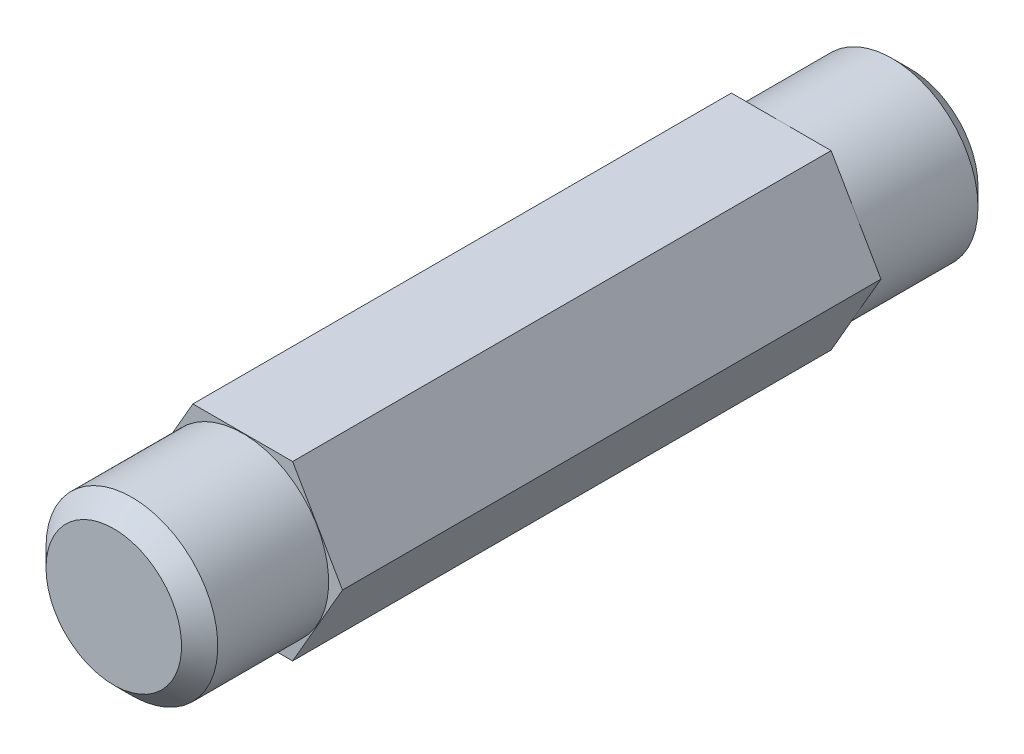
ISO-10303-21;
HEADER;
FILE_DESCRIPTION(('STEP AP214'),'2;1');
FILE_NAME('part.step','',(''),(''),'','','');
FILE_SCHEMA(('AUTOMOTIVE_DESIGN { 1 0 10303 214 1 1 1 1 }'));
ENDSEC;
DATA;
#1=APPLICATION_CONTEXT('core data for automotive mechanical design processes');
#2=APPLICATION_PROTOCOL_DEFINITION('international standard','automotive_design',2000,#1);
#3=PRODUCT_CONTEXT('',#1,'mechanical');
#4=PRODUCT('Part','Part','',(#3));
#5=PRODUCT_RELATED_PRODUCT_CATEGORY('part','',(#4));
#6=PRODUCT_DEFINITION_FORMATION('','',#4);
#7=PRODUCT_DEFINITION_CONTEXT('part definition',#1,'design');
#8=PRODUCT_DEFINITION('design','',#6,#7);
#9=PRODUCT_DEFINITION_SHAPE('','',#8);
#10=(LENGTH_UNIT() NAMED_UNIT(*) SI_UNIT(.MILLI.,.METRE.));
#11=(NAMED_UNIT(*) PLANE_ANGLE_UNIT() SI_UNIT($,.RADIAN.));
#12=(NAMED_UNIT(*) SI_UNIT($,.STERADIAN.) SOLID_ANGLE_UNIT());
#13=UNCERTAINTY_MEASURE_WITH_UNIT(LENGTH_MEASURE(1.E-05),#10,'distance_accuracy_value','');
#14=(GEOMETRIC_REPRESENTATION_CONTEXT(3) GLOBAL_UNCERTAINTY_ASSIGNED_CONTEXT((#13)) GLOBAL_UNIT_ASSIGNED_CONTEXT((#10,
#11,#12)) REPRESENTATION_CONTEXT('',''));
#15=CARTESIAN_POINT('',(0.,0.,0.));
#16=DIRECTION('',(0.,0.,1.));
#17=DIRECTION('',(1.,0.,0.));
#18=AXIS2_PLACEMENT_3D('',#15,#16,#17);
#19=CARTESIAN_POINT('',(0.,0.,21.9583));
#20=DIRECTION('',(0.,0.,1.));
#21=DIRECTION('',(1.,0.,0.));
#22=AXIS2_PLACEMENT_3D('',#19,#20,#21);
#23=PLANE('',#22);
#24=CARTESIAN_POINT('',(0.,0.,21.9582999999943));
#25=DIRECTION('',(0.,0.,-1.));
#26=DIRECTION('',(-1.,0.,0.));
#27=AXIS2_PLACEMENT_3D('',#24,#25,#26);
#28=CIRCLE('',#27,3.73710000002347);
#29=CARTESIAN_POINT('',(-3.73710000002347,0.,21.9582999999943));
#30=VERTEX_POINT('',#29);
#31=EDGE_CURVE('E20',#30,#30,#28,.T.);
#32=ORIENTED_EDGE('',*,*,#31,.F.);
#33=EDGE_LOOP('',(#32));
#34=FACE_BOUND('',#33,.T.);
#35=ADVANCED_FACE('F17',(#34),#23,.T.);
#36=CARTESIAN_POINT('',(0.,0.,-21.9583));
#37=DIRECTION('',(0.,0.,-1.));
#38=DIRECTION('',(-1.,0.,0.));
#39=AXIS2_PLACEMENT_3D('',#36,#37,#38);
#40=PLANE('',#39);
#41=CARTESIAN_POINT('',(0.,0.,-21.9583000000512));
#42=DIRECTION('',(0.,0.,1.));
#43=DIRECTION('',(1.,0.,0.));
#44=AXIS2_PLACEMENT_3D('',#41,#42,#43);
#45=CIRCLE('',#44,3.73709999996663);
#46=CARTESIAN_POINT('',(3.73709999996663,0.,-21.9583000000512));
#47=VERTEX_POINT('',#46);
#48=EDGE_CURVE('E106',#47,#47,#45,.T.);
#49=ORIENTED_EDGE('',*,*,#48,.F.);
#50=EDGE_LOOP('',(#49));
#51=FACE_BOUND('',#50,.T.);
#52=ADVANCED_FACE('F124',(#51),#40,.T.);
#53=CARTESIAN_POINT('',(0.,0.,20.9582999999043));
#54=DIRECTION('',(0.,0.,-1.));
#55=DIRECTION('',(-1.,0.,0.));
#56=AXIS2_PLACEMENT_3D('',#53,#54,#55);
#57=CONICAL_SURFACE('',#56,4.73710000011351,0.785398163397448);
#58=CARTESIAN_POINT('',(0.,0.,20.9583));
#59=DIRECTION('',(0.,0.,-1.));
#60=DIRECTION('',(-1.,0.,0.));
#61=AXIS2_PLACEMENT_3D('',#58,#59,#60);
#62=CIRCLE('',#61,4.7371);
#63=CARTESIAN_POINT('',(-4.7371,0.,20.9583));
#64=VERTEX_POINT('',#63);
#65=EDGE_CURVE('E103',#64,#64,#62,.T.);
#66=ORIENTED_EDGE('',*,*,#65,.F.);
#67=EDGE_LOOP('',(#66));
#68=FACE_BOUND('',#67,.T.);
#69=ORIENTED_EDGE('',*,*,#31,.T.);
#70=EDGE_LOOP('',(#69));
#71=FACE_BOUND('',#70,.T.);
#72=ADVANCED_FACE('F121',(#68,#71),#57,.T.);
#73=CARTESIAN_POINT('',(0.,0.,-20.958300000018));
#74=DIRECTION('',(0.,0.,1.));
#75=DIRECTION('',(1.,0.,0.));
#76=AXIS2_PLACEMENT_3D('',#73,#74,#75);
#77=CONICAL_SURFACE('',#76,4.73709999994298,0.785398163369027);
#78=CARTESIAN_POINT('',(0.,0.,-20.9583));
#79=DIRECTION('',(0.,0.,1.));
#80=DIRECTION('',(1.,0.,0.));
#81=AXIS2_PLACEMENT_3D('',#78,#79,#80);
#82=CIRCLE('',#81,4.7371);
#83=CARTESIAN_POINT('',(4.7371,0.,-20.9583));
#84=VERTEX_POINT('',#83);
#85=EDGE_CURVE('E100',#84,#84,#82,.T.);
#86=ORIENTED_EDGE('',*,*,#85,.F.);
#87=EDGE_LOOP('',(#86));
#88=FACE_BOUND('',#87,.T.);
#89=ORIENTED_EDGE('',*,*,#48,.T.);
#90=EDGE_LOOP('',(#89));
#91=FACE_BOUND('',#90,.T.);
#92=ADVANCED_FACE('F166',(#88,#91),#77,.T.);
#93=CARTESIAN_POINT('',(0.,0.,21.9583));
#94=DIRECTION('',(0.,0.,-1.));
#95=DIRECTION('',(-1.,0.,0.));
#96=AXIS2_PLACEMENT_3D('',#93,#94,#95);
#97=CYLINDRICAL_SURFACE('',#96,4.7371);
#98=CARTESIAN_POINT('',(0.,0.,14.8463));
#99=DIRECTION('',(0.,0.,-1.));
#100=DIRECTION('',(-1.,0.,0.));
#101=AXIS2_PLACEMENT_3D('',#98,#99,#100);
#102=CIRCLE('',#101,4.7371);
#103=CARTESIAN_POINT('',(-4.7371,0.,14.8463));
#104=VERTEX_POINT('',#103);
#105=EDGE_CURVE('E112',#104,#104,#102,.T.);
#106=ORIENTED_EDGE('',*,*,#105,.F.);
#107=EDGE_LOOP('',(#106));
#108=FACE_BOUND('',#107,.T.);
#109=ORIENTED_EDGE('',*,*,#65,.T.);
#110=EDGE_LOOP('',(#109));
#111=FACE_BOUND('',#110,.T.);
#112=ADVANCED_FACE('F162',(#108,#111),#97,.T.);
#113=CARTESIAN_POINT('',(0.,0.,-21.9583));
#114=DIRECTION('',(0.,0.,1.));
#115=DIRECTION('',(1.,0.,0.));
#116=AXIS2_PLACEMENT_3D('',#113,#114,#115);
#117=CYLINDRICAL_SURFACE('',#116,4.7371);
#118=CARTESIAN_POINT('',(0.,0.,-14.8463));
#119=DIRECTION('',(0.,0.,1.));
#120=DIRECTION('',(1.,0.,0.));
#121=AXIS2_PLACEMENT_3D('',#118,#119,#120);
#122=CIRCLE('',#121,4.7371);
#123=CARTESIAN_POINT('',(4.7371,0.,-14.8463));
#124=VERTEX_POINT('',#123);
#125=EDGE_CURVE('E107',#124,#124,#122,.F.);
#126=ORIENTED_EDGE('',*,*,#125,.T.);
#127=EDGE_LOOP('',(#126));
#128=FACE_BOUND('',#127,.T.);
#129=ORIENTED_EDGE('',*,*,#85,.T.);
#130=EDGE_LOOP('',(#129));
#131=FACE_BOUND('',#130,.T.);
#132=ADVANCED_FACE('F159',(#128,#131),#117,.T.);
#133=CARTESIAN_POINT('',(5.49926131403118,0.,14.8463));
#134=DIRECTION('',(-0.866025403784439,-0.5,0.));
#135=DIRECTION('',(0.5,-0.866025403784439,0.));
#136=AXIS2_PLACEMENT_3D('',#133,#134,#135);
#137=PLANE('',#136);
#138=DIRECTION('',(0.,0.,-1.));
#139=VECTOR('',#138,1.);
#140=CARTESIAN_POINT('',(2.74963065701559,4.7625,14.8463));
#141=LINE('',#140,#139);
#142=CARTESIAN_POINT('',(2.74963065701559,4.7625,-14.8463));
#143=VERTEX_POINT('',#142);
#144=CARTESIAN_POINT('',(2.74963065701559,4.7625,14.8463));
#145=VERTEX_POINT('',#144);
#146=EDGE_CURVE('E82',#143,#145,#141,.F.);
#147=ORIENTED_EDGE('',*,*,#146,.T.);
#148=DIRECTION('',(-0.5,0.866025403784439,0.));
#149=VECTOR('',#148,1.);
#150=CARTESIAN_POINT('',(5.49926131403118,0.,14.8463));
#151=LINE('',#150,#149);
#152=CARTESIAN_POINT('',(5.49926131403118,0.,14.8463));
#153=VERTEX_POINT('',#152);
#154=EDGE_CURVE('E87',#153,#145,#151,.T.);
#155=ORIENTED_EDGE('',*,*,#154,.F.);
#156=DIRECTION('',(0.,0.,1.));
#157=VECTOR('',#156,1.);
#158=CARTESIAN_POINT('',(5.49926131403118,0.,14.8463));
#159=LINE('',#158,#157);
#160=CARTESIAN_POINT('',(5.49926131403118,0.,-14.8463));
#161=VERTEX_POINT('',#160);
#162=EDGE_CURVE('E73',#153,#161,#159,.F.);
#163=ORIENTED_EDGE('',*,*,#162,.T.);
#164=DIRECTION('',(-0.5,0.866025403784439,0.));
#165=VECTOR('',#164,1.);
#166=CARTESIAN_POINT('',(5.49926131403118,0.,-14.8463));
#167=LINE('',#166,#165);
#168=EDGE_CURVE('E110',#161,#143,#167,.T.);
#169=ORIENTED_EDGE('',*,*,#168,.T.);
#170=EDGE_LOOP('',(#147,#155,#163,#169));
#171=FACE_BOUND('',#170,.T.);
#172=ADVANCED_FACE('F91',(#171),#137,.F.);
#173=CARTESIAN_POINT('',(-2.74963065701559,-4.7625,14.8463));
#174=DIRECTION('',(0.,1.,0.));
#175=DIRECTION('',(0.,0.,1.));
#176=AXIS2_PLACEMENT_3D('',#173,#174,#175);
#177=PLANE('',#176);
#178=DIRECTION('',(0.,0.,1.));
#179=VECTOR('',#178,1.);
#180=CARTESIAN_POINT('',(2.74963065701559,-4.7625,14.8463));
#181=LINE('',#180,#179);
#182=CARTESIAN_POINT('',(2.74963065701559,-4.7625,-14.8463));
#183=VERTEX_POINT('',#182);
#184=CARTESIAN_POINT('',(2.74963065701559,-4.7625,14.8463));
#185=VERTEX_POINT('',#184);
#186=EDGE_CURVE('E66',#183,#185,#181,.T.);
#187=ORIENTED_EDGE('',*,*,#186,.T.);
#188=DIRECTION('',(1.,0.,0.));
#189=VECTOR('',#188,1.);
#190=CARTESIAN_POINT('',(5.49926131403118,-4.7625,14.8463));
#191=LINE('',#190,#189);
#192=CARTESIAN_POINT('',(-2.74963065701559,-4.7625,14.8463));
#193=VERTEX_POINT('',#192);
#194=EDGE_CURVE('E89',#193,#185,#191,.T.);
#195=ORIENTED_EDGE('',*,*,#194,.F.);
#196=DIRECTION('',(0.,0.,1.));
#197=VECTOR('',#196,1.);
#198=CARTESIAN_POINT('',(-2.74963065701559,-4.7625,14.8463));
#199=LINE('',#198,#197);
#200=CARTESIAN_POINT('',(-2.74963065701559,-4.7625,-14.8463));
#201=VERTEX_POINT('',#200);
#202=EDGE_CURVE('E111',#193,#201,#199,.F.);
#203=ORIENTED_EDGE('',*,*,#202,.T.);
#204=DIRECTION('',(1.,0.,0.));
#205=VECTOR('',#204,1.);
#206=CARTESIAN_POINT('',(5.49926131403118,-4.7625,-14.8463));
#207=LINE('',#206,#205);
#208=EDGE_CURVE('E277',#201,#183,#207,.T.);
#209=ORIENTED_EDGE('',*,*,#208,.T.);
#210=EDGE_LOOP('',(#187,#195,#203,#209));
#211=FACE_BOUND('',#210,.T.);
#212=ADVANCED_FACE('F154',(#211),#177,.F.);
#213=CARTESIAN_POINT('',(2.74963065701559,-4.7625,14.8463));
#214=DIRECTION('',(-0.866025403784439,0.5,0.));
#215=DIRECTION('',(-0.5,-0.866025403784439,0.));
#216=AXIS2_PLACEMENT_3D('',#213,#214,#215);
#217=PLANE('',#216);
#218=ORIENTED_EDGE('',*,*,#162,.F.);
#219=DIRECTION('',(0.5,0.866025403784439,0.));
#220=VECTOR('',#219,1.);
#221=CARTESIAN_POINT('',(2.74963065701559,-4.7625,14.8463));
#222=LINE('',#221,#220);
#223=EDGE_CURVE('E76',#185,#153,#222,.T.);
#224=ORIENTED_EDGE('',*,*,#223,.F.);
#225=ORIENTED_EDGE('',*,*,#186,.F.);
#226=DIRECTION('',(0.5,0.866025403784439,0.));
#227=VECTOR('',#226,1.);
#228=CARTESIAN_POINT('',(2.74963065701559,-4.7625,-14.8463));
#229=LINE('',#228,#227);
#230=EDGE_CURVE('E78',#183,#161,#229,.T.);
#231=ORIENTED_EDGE('',*,*,#230,.T.);
#232=EDGE_LOOP('',(#218,#224,#225,#231));
#233=FACE_BOUND('',#232,.T.);
#234=ADVANCED_FACE('F75',(#233),#217,.F.);
#235=CARTESIAN_POINT('',(2.74963065701559,4.7625,14.8463));
#236=DIRECTION('',(0.,-1.,0.));
#237=DIRECTION('',(0.,0.,-1.));
#238=AXIS2_PLACEMENT_3D('',#235,#236,#237);
#239=PLANE('',#238);
#240=DIRECTION('',(0.,0.,1.));
#241=VECTOR('',#240,1.);
#242=CARTESIAN_POINT('',(-2.74963065701559,4.7625,14.8463));
#243=LINE('',#242,#241);
#244=CARTESIAN_POINT('',(-2.74963065701559,4.7625,-14.8463));
#245=VERTEX_POINT('',#244);
#246=CARTESIAN_POINT('',(-2.74963065701559,4.7625,14.8463));
#247=VERTEX_POINT('',#246);
#248=EDGE_CURVE('E269',#245,#247,#243,.T.);
#249=ORIENTED_EDGE('',*,*,#248,.T.);
#250=DIRECTION('',(1.,0.,0.));
#251=VECTOR('',#250,1.);
#252=CARTESIAN_POINT('',(5.49926131403118,4.7625,14.8463));
#253=LINE('',#252,#251);
#254=EDGE_CURVE('E93',#145,#247,#253,.F.);
#255=ORIENTED_EDGE('',*,*,#254,.F.);
#256=ORIENTED_EDGE('',*,*,#146,.F.);
#257=DIRECTION('',(1.,0.,0.));
#258=VECTOR('',#257,1.);
#259=CARTESIAN_POINT('',(5.49926131403118,4.7625,-14.8463));
#260=LINE('',#259,#258);
#261=EDGE_CURVE('E271',#143,#245,#260,.F.);
#262=ORIENTED_EDGE('',*,*,#261,.T.);
#263=EDGE_LOOP('',(#249,#255,#256,#262));
#264=FACE_BOUND('',#263,.T.);
#265=ADVANCED_FACE('F147',(#264),#239,.F.);
#266=CARTESIAN_POINT('',(5.49926131403118,0.,14.8463));
#267=DIRECTION('',(0.,0.,1.));
#268=DIRECTION('',(1.,0.,0.));
#269=AXIS2_PLACEMENT_3D('',#266,#267,#268);
#270=PLANE('',#269);
#271=ORIENTED_EDGE('',*,*,#105,.T.);
#272=EDGE_LOOP('',(#271));
#273=FACE_BOUND('',#272,.T.);
#274=DIRECTION('',(-0.5,0.866025403784439,0.));
#275=VECTOR('',#274,1.);
#276=CARTESIAN_POINT('',(-5.49926131403119,0.,14.8463));
#277=LINE('',#276,#275);
#278=CARTESIAN_POINT('',(-5.49926131403119,0.,14.8463));
#279=VERTEX_POINT('',#278);
#280=EDGE_CURVE('E114',#279,#193,#277,.F.);
#281=ORIENTED_EDGE('',*,*,#280,.T.);
#282=ORIENTED_EDGE('',*,*,#194,.T.);
#283=ORIENTED_EDGE('',*,*,#223,.T.);
#284=ORIENTED_EDGE('',*,*,#154,.T.);
#285=ORIENTED_EDGE('',*,*,#254,.T.);
#286=DIRECTION('',(0.5,0.866025403784439,0.));
#287=VECTOR('',#286,1.);
#288=CARTESIAN_POINT('',(-2.74963065701559,4.7625,14.8463));
#289=LINE('',#288,#287);
#290=EDGE_CURVE('E273',#247,#279,#289,.F.);
#291=ORIENTED_EDGE('',*,*,#290,.T.);
#292=EDGE_LOOP('',(#281,#282,#283,#284,#285,#291));
#293=FACE_BOUND('',#292,.T.);
#294=ADVANCED_FACE('F86',(#273,#293),#270,.T.);
#295=CARTESIAN_POINT('',(-5.49926131403119,0.,14.8463));
#296=DIRECTION('',(0.866025403784439,0.5,0.));
#297=DIRECTION('',(-0.5,0.866025403784439,0.));
#298=AXIS2_PLACEMENT_3D('',#295,#296,#297);
#299=PLANE('',#298);
#300=ORIENTED_EDGE('',*,*,#202,.F.);
#301=ORIENTED_EDGE('',*,*,#280,.F.);
#302=DIRECTION('',(0.,0.,1.));
#303=VECTOR('',#302,1.);
#304=CARTESIAN_POINT('',(-5.49926131403119,0.,14.8463));
#305=LINE('',#304,#303);
#306=CARTESIAN_POINT('',(-5.49926131403119,0.,-14.8463));
#307=VERTEX_POINT('',#306);
#308=EDGE_CURVE('E26',#279,#307,#305,.F.);
#309=ORIENTED_EDGE('',*,*,#308,.T.);
#310=DIRECTION('',(0.5,-0.866025403784439,0.));
#311=VECTOR('',#310,1.);
#312=CARTESIAN_POINT('',(-5.49926131403119,0.,-14.8463));
#313=LINE('',#312,#311);
#314=EDGE_CURVE('E34',#307,#201,#313,.T.);
#315=ORIENTED_EDGE('',*,*,#314,.T.);
#316=EDGE_LOOP('',(#300,#301,#309,#315));
#317=FACE_BOUND('',#316,.T.);
#318=ADVANCED_FACE('F138',(#317),#299,.F.);
#319=CARTESIAN_POINT('',(5.49926131403118,0.,-14.8463));
#320=DIRECTION('',(0.,0.,1.));
#321=DIRECTION('',(1.,0.,0.));
#322=AXIS2_PLACEMENT_3D('',#319,#320,#321);
#323=PLANE('',#322);
#324=ORIENTED_EDGE('',*,*,#208,.F.);
#325=ORIENTED_EDGE('',*,*,#314,.F.);
#326=DIRECTION('',(0.5,0.866025403784439,0.));
#327=VECTOR('',#326,1.);
#328=CARTESIAN_POINT('',(-2.74963065701559,4.7625,-14.8463));
#329=LINE('',#328,#327);
#330=EDGE_CURVE('E11',#307,#245,#329,.T.);
#331=ORIENTED_EDGE('',*,*,#330,.T.);
#332=ORIENTED_EDGE('',*,*,#261,.F.);
#333=ORIENTED_EDGE('',*,*,#168,.F.);
#334=ORIENTED_EDGE('',*,*,#230,.F.);
#335=EDGE_LOOP('',(#324,#325,#331,#332,#333,#334));
#336=FACE_BOUND('',#335,.T.);
#337=ORIENTED_EDGE('',*,*,#125,.F.);
#338=EDGE_LOOP('',(#337));
#339=FACE_BOUND('',#338,.T.);
#340=ADVANCED_FACE('F132',(#336,#339),#323,.F.);
#341=CARTESIAN_POINT('',(-2.74963065701559,4.7625,14.8463));
#342=DIRECTION('',(0.866025403784439,-0.5,0.));
#343=DIRECTION('',(0.5,0.866025403784439,0.));
#344=AXIS2_PLACEMENT_3D('',#341,#342,#343);
#345=PLANE('',#344);
#346=ORIENTED_EDGE('',*,*,#308,.F.);
#347=ORIENTED_EDGE('',*,*,#290,.F.);
#348=ORIENTED_EDGE('',*,*,#248,.F.);
#349=ORIENTED_EDGE('',*,*,#330,.F.);
#350=EDGE_LOOP('',(#346,#347,#348,#349));
#351=FACE_BOUND('',#350,.T.);
#352=ADVANCED_FACE('F130',(#351),#345,.F.);
#353=CLOSED_SHELL('',(#35,#52,#72,#92,#112,#132,#172,#212,#234,#265,#294,#318,#340,#352));
#354=MANIFOLD_SOLID_BREP('B1',#353);
#355=ADVANCED_BREP_SHAPE_REPRESENTATION('',(#18,#354),#14);
#356=SHAPE_DEFINITION_REPRESENTATION(#9,#355);
ENDSEC;
END-ISO-10303-21;
